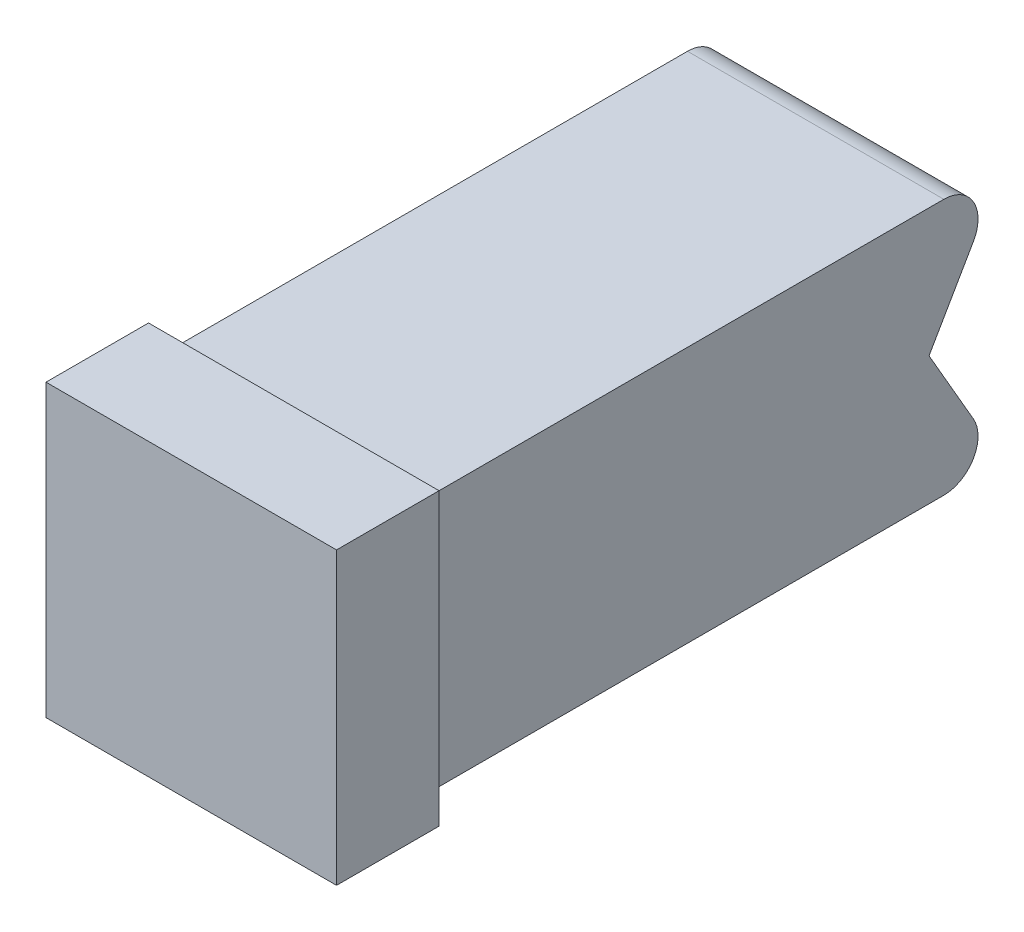
ISO-10303-21;
HEADER;
FILE_DESCRIPTION(('STEP AP214'),'2;1');
FILE_NAME('part.step','',(''),(''),'','','');
FILE_SCHEMA(('AUTOMOTIVE_DESIGN { 1 0 10303 214 1 1 1 1 }'));
ENDSEC;
DATA;
#1=APPLICATION_CONTEXT('core data for automotive mechanical design processes');
#2=APPLICATION_PROTOCOL_DEFINITION('international standard','automotive_design',2000,#1);
#3=PRODUCT_CONTEXT('',#1,'mechanical');
#4=PRODUCT('Part','Part','',(#3));
#5=PRODUCT_RELATED_PRODUCT_CATEGORY('part','',(#4));
#6=PRODUCT_DEFINITION_FORMATION('','',#4);
#7=PRODUCT_DEFINITION_CONTEXT('part definition',#1,'design');
#8=PRODUCT_DEFINITION('design','',#6,#7);
#9=PRODUCT_DEFINITION_SHAPE('','',#8);
#10=(LENGTH_UNIT() NAMED_UNIT(*) SI_UNIT(.MILLI.,.METRE.));
#11=(NAMED_UNIT(*) PLANE_ANGLE_UNIT() SI_UNIT($,.RADIAN.));
#12=(NAMED_UNIT(*) SI_UNIT($,.STERADIAN.) SOLID_ANGLE_UNIT());
#13=UNCERTAINTY_MEASURE_WITH_UNIT(LENGTH_MEASURE(1.E-05),#10,'distance_accuracy_value','');
#14=(GEOMETRIC_REPRESENTATION_CONTEXT(3) GLOBAL_UNCERTAINTY_ASSIGNED_CONTEXT((#13)) GLOBAL_UNIT_ASSIGNED_CONTEXT((#10,
#11,#12)) REPRESENTATION_CONTEXT('',''));
#15=CARTESIAN_POINT('',(0.,0.,0.));
#16=DIRECTION('',(0.,0.,1.));
#17=DIRECTION('',(1.,0.,0.));
#18=AXIS2_PLACEMENT_3D('',#15,#16,#17);
#19=CARTESIAN_POINT('',(0.,8.5,0.));
#20=DIRECTION('',(0.,-1.,0.));
#21=DIRECTION('',(0.,0.,-1.));
#22=AXIS2_PLACEMENT_3D('',#19,#20,#21);
#23=PLANE('',#22);
#24=DIRECTION('',(1.,0.,0.));
#25=VECTOR('',#24,1.);
#26=CARTESIAN_POINT('',(0.5,8.5,0.));
#27=LINE('',#26,#25);
#28=CARTESIAN_POINT('',(0.,8.5,0.));
#29=VERTEX_POINT('',#28);
#30=CARTESIAN_POINT('',(8.5,8.5,0.));
#31=VERTEX_POINT('',#30);
#32=EDGE_CURVE('E185',#29,#31,#27,.T.);
#33=ORIENTED_EDGE('',*,*,#32,.F.);
#34=DIRECTION('',(0.,0.,-1.));
#35=VECTOR('',#34,1.);
#36=CARTESIAN_POINT('',(0.,8.5,0.));
#37=LINE('',#36,#35);
#38=CARTESIAN_POINT('',(0.,8.5,3.));
#39=VERTEX_POINT('',#38);
#40=EDGE_CURVE('E327',#39,#29,#37,.T.);
#41=ORIENTED_EDGE('',*,*,#40,.F.);
#42=DIRECTION('',(1.,0.,0.));
#43=VECTOR('',#42,1.);
#44=CARTESIAN_POINT('',(8.,8.5,3.));
#45=LINE('',#44,#43);
#46=CARTESIAN_POINT('',(8.5,8.5,3.));
#47=VERTEX_POINT('',#46);
#48=EDGE_CURVE('E120',#39,#47,#45,.T.);
#49=ORIENTED_EDGE('',*,*,#48,.T.);
#50=DIRECTION('',(0.,0.,1.));
#51=VECTOR('',#50,1.);
#52=CARTESIAN_POINT('',(8.5,8.5,3.));
#53=LINE('',#52,#51);
#54=EDGE_CURVE('E130',#31,#47,#53,.T.);
#55=ORIENTED_EDGE('',*,*,#54,.F.);
#56=EDGE_LOOP('',(#33,#41,#49,#55));
#57=FACE_BOUND('',#56,.T.);
#58=ADVANCED_FACE('F37',(#57),#23,.F.);
#59=CARTESIAN_POINT('',(8.5,0.,0.));
#60=DIRECTION('',(-1.,0.,0.));
#61=DIRECTION('',(0.,0.,1.));
#62=AXIS2_PLACEMENT_3D('',#59,#60,#61);
#63=PLANE('',#62);
#64=DIRECTION('',(0.,-1.,0.));
#65=VECTOR('',#64,1.);
#66=CARTESIAN_POINT('',(8.5,8.5,0.));
#67=LINE('',#66,#65);
#68=CARTESIAN_POINT('',(8.5,0.,0.));
#69=VERTEX_POINT('',#68);
#70=EDGE_CURVE('E181',#31,#69,#67,.T.);
#71=ORIENTED_EDGE('',*,*,#70,.F.);
#72=ORIENTED_EDGE('',*,*,#54,.T.);
#73=DIRECTION('',(0.,-1.,0.));
#74=VECTOR('',#73,1.);
#75=CARTESIAN_POINT('',(8.5,0.5,3.));
#76=LINE('',#75,#74);
#77=CARTESIAN_POINT('',(8.5,0.,3.));
#78=VERTEX_POINT('',#77);
#79=EDGE_CURVE('E122',#47,#78,#76,.T.);
#80=ORIENTED_EDGE('',*,*,#79,.T.);
#81=DIRECTION('',(0.,0.,1.));
#82=VECTOR('',#81,1.);
#83=CARTESIAN_POINT('',(8.5,0.,3.));
#84=LINE('',#83,#82);
#85=EDGE_CURVE('E167',#69,#78,#84,.T.);
#86=ORIENTED_EDGE('',*,*,#85,.F.);
#87=EDGE_LOOP('',(#71,#72,#80,#86));
#88=FACE_BOUND('',#87,.T.);
#89=ADVANCED_FACE('F175',(#88),#63,.F.);
#90=CARTESIAN_POINT('',(0.,0.,0.));
#91=DIRECTION('',(0.,1.,0.));
#92=DIRECTION('',(0.,0.,1.));
#93=AXIS2_PLACEMENT_3D('',#90,#91,#92);
#94=PLANE('',#93);
#95=DIRECTION('',(-1.,0.,0.));
#96=VECTOR('',#95,1.);
#97=CARTESIAN_POINT('',(8.5,0.,0.));
#98=LINE('',#97,#96);
#99=CARTESIAN_POINT('',(0.,0.,0.));
#100=VERTEX_POINT('',#99);
#101=EDGE_CURVE('E208',#69,#100,#98,.T.);
#102=ORIENTED_EDGE('',*,*,#101,.F.);
#103=ORIENTED_EDGE('',*,*,#85,.T.);
#104=DIRECTION('',(-1.,0.,0.));
#105=VECTOR('',#104,1.);
#106=CARTESIAN_POINT('',(0.5,0.,3.));
#107=LINE('',#106,#105);
#108=CARTESIAN_POINT('',(0.,0.,3.));
#109=VERTEX_POINT('',#108);
#110=EDGE_CURVE('E170',#78,#109,#107,.T.);
#111=ORIENTED_EDGE('',*,*,#110,.T.);
#112=DIRECTION('',(0.,0.,1.));
#113=VECTOR('',#112,1.);
#114=CARTESIAN_POINT('',(0.,0.,3.));
#115=LINE('',#114,#113);
#116=EDGE_CURVE('E210',#100,#109,#115,.T.);
#117=ORIENTED_EDGE('',*,*,#116,.F.);
#118=EDGE_LOOP('',(#102,#103,#111,#117));
#119=FACE_BOUND('',#118,.T.);
#120=ADVANCED_FACE('F203',(#119),#94,.F.);
#121=CARTESIAN_POINT('',(8.,7.,-15.2679491924311));
#122=DIRECTION('',(-1.,0.,0.));
#123=DIRECTION('',(0.,0.,1.));
#124=AXIS2_PLACEMENT_3D('',#121,#122,#123);
#125=PLANE('',#124);
#126=CARTESIAN_POINT('',(8.,7.,-15.2679491924311));
#127=DIRECTION('',(-1.,0.,0.));
#128=DIRECTION('',(0.,0.,1.));
#129=AXIS2_PLACEMENT_3D('',#126,#127,#128);
#130=CIRCLE('',#129,1.00000000000001);
#131=CARTESIAN_POINT('',(8.,8.,-15.2679491924311));
#132=VERTEX_POINT('',#131);
#133=CARTESIAN_POINT('',(8.,6.50000000000001,-16.1339745962156));
#134=VERTEX_POINT('',#133);
#135=EDGE_CURVE('E95',#132,#134,#130,.T.);
#136=ORIENTED_EDGE('',*,*,#135,.F.);
#137=DIRECTION('',(0.,0.,-1.));
#138=VECTOR('',#137,1.);
#139=CARTESIAN_POINT('',(8.,8.,-14.8349364905389));
#140=LINE('',#139,#138);
#141=CARTESIAN_POINT('',(8.,8.,0.));
#142=VERTEX_POINT('',#141);
#143=EDGE_CURVE('E154',#142,#132,#140,.T.);
#144=ORIENTED_EDGE('',*,*,#143,.F.);
#145=DIRECTION('',(0.,1.,0.));
#146=VECTOR('',#145,1.);
#147=CARTESIAN_POINT('',(8.,0.5,0.));
#148=LINE('',#147,#146);
#149=CARTESIAN_POINT('',(8.,0.5,0.));
#150=VERTEX_POINT('',#149);
#151=EDGE_CURVE('E148',#150,#142,#148,.T.);
#152=ORIENTED_EDGE('',*,*,#151,.F.);
#153=DIRECTION('',(0.,0.,-1.));
#154=VECTOR('',#153,1.);
#155=CARTESIAN_POINT('',(8.,0.5,-14.8349364905389));
#156=LINE('',#155,#154);
#157=CARTESIAN_POINT('',(8.,0.5,-15.2679491924311));
#158=VERTEX_POINT('',#157);
#159=EDGE_CURVE('E144',#150,#158,#156,.T.);
#160=ORIENTED_EDGE('',*,*,#159,.T.);
#161=CARTESIAN_POINT('',(8.,1.5,-15.2679491924311));
#162=DIRECTION('',(-1.,0.,0.));
#163=DIRECTION('',(0.,0.,1.));
#164=AXIS2_PLACEMENT_3D('',#161,#162,#163);
#165=CIRCLE('',#164,1.00000000000001);
#166=CARTESIAN_POINT('',(8.,1.99999999999999,-16.1339745962156));
#167=VERTEX_POINT('',#166);
#168=EDGE_CURVE('E107',#167,#158,#165,.T.);
#169=ORIENTED_EDGE('',*,*,#168,.F.);
#170=DIRECTION('',(0.,-0.866025403784438,-0.500000000000001));
#171=VECTOR('',#170,1.);
#172=CARTESIAN_POINT('',(8.,4.25,-14.8349364905389));
#173=LINE('',#172,#171);
#174=CARTESIAN_POINT('',(8.,4.25000000000001,-14.8349364905389));
#175=VERTEX_POINT('',#174);
#176=EDGE_CURVE('E56',#175,#167,#173,.T.);
#177=ORIENTED_EDGE('',*,*,#176,.F.);
#178=DIRECTION('',(0.,-0.866025403784437,0.500000000000003));
#179=VECTOR('',#178,1.);
#180=CARTESIAN_POINT('',(8.,6.5,-16.1339745962156));
#181=LINE('',#180,#179);
#182=EDGE_CURVE('E98',#134,#175,#181,.T.);
#183=ORIENTED_EDGE('',*,*,#182,.F.);
#184=EDGE_LOOP('',(#136,#144,#152,#160,#169,#177,#183));
#185=FACE_BOUND('',#184,.T.);
#186=ADVANCED_FACE('F140',(#185),#125,.F.);
#187=CARTESIAN_POINT('',(8.,1.5,-15.2679491924311));
#188=DIRECTION('',(-1.,0.,0.));
#189=DIRECTION('',(0.,0.,1.));
#190=AXIS2_PLACEMENT_3D('',#187,#188,#189);
#191=CYLINDRICAL_SURFACE('',#190,1.00000000000001);
#192=CARTESIAN_POINT('',(0.5,1.5,-15.2679491924311));
#193=DIRECTION('',(-1.,0.,0.));
#194=DIRECTION('',(0.,0.,1.));
#195=AXIS2_PLACEMENT_3D('',#192,#193,#194);
#196=CIRCLE('',#195,1.00000000000001);
#197=CARTESIAN_POINT('',(0.5,1.99999999999999,-16.1339745962156));
#198=VERTEX_POINT('',#197);
#199=CARTESIAN_POINT('',(0.5,0.5,-15.2679491924311));
#200=VERTEX_POINT('',#199);
#201=EDGE_CURVE('E88',#198,#200,#196,.T.);
#202=ORIENTED_EDGE('',*,*,#201,.F.);
#203=DIRECTION('',(-1.,0.,0.));
#204=VECTOR('',#203,1.);
#205=CARTESIAN_POINT('',(8.,1.99999999999999,-16.1339745962156));
#206=LINE('',#205,#204);
#207=EDGE_CURVE('E72',#167,#198,#206,.T.);
#208=ORIENTED_EDGE('',*,*,#207,.F.);
#209=ORIENTED_EDGE('',*,*,#168,.T.);
#210=DIRECTION('',(-1.,0.,0.));
#211=VECTOR('',#210,1.);
#212=CARTESIAN_POINT('',(8.,0.499999999999993,-15.2679491924311));
#213=LINE('',#212,#211);
#214=EDGE_CURVE('E47',#158,#200,#213,.T.);
#215=ORIENTED_EDGE('',*,*,#214,.T.);
#216=EDGE_LOOP('',(#202,#208,#209,#215));
#217=FACE_BOUND('',#216,.T.);
#218=ADVANCED_FACE('F93',(#217),#191,.T.);
#219=CARTESIAN_POINT('',(8.,4.25,-14.8349364905389));
#220=DIRECTION('',(0.,0.500000000000001,-0.866025403784438));
#221=DIRECTION('',(0.,0.866025403784438,0.500000000000001));
#222=AXIS2_PLACEMENT_3D('',#219,#220,#221);
#223=PLANE('',#222);
#224=DIRECTION('',(0.,-0.866025403784438,-0.500000000000001));
#225=VECTOR('',#224,1.);
#226=CARTESIAN_POINT('',(0.5,4.25,-14.8349364905389));
#227=LINE('',#226,#225);
#228=CARTESIAN_POINT('',(0.5,4.25,-14.8349364905389));
#229=VERTEX_POINT('',#228);
#230=EDGE_CURVE('E75',#229,#198,#227,.T.);
#231=ORIENTED_EDGE('',*,*,#230,.F.);
#232=DIRECTION('',(-1.,0.,0.));
#233=VECTOR('',#232,1.);
#234=CARTESIAN_POINT('',(8.,4.25,-14.8349364905389));
#235=LINE('',#234,#233);
#236=EDGE_CURVE('E70',#175,#229,#235,.T.);
#237=ORIENTED_EDGE('',*,*,#236,.F.);
#238=ORIENTED_EDGE('',*,*,#176,.T.);
#239=ORIENTED_EDGE('',*,*,#207,.T.);
#240=EDGE_LOOP('',(#231,#237,#238,#239));
#241=FACE_BOUND('',#240,.T.);
#242=ADVANCED_FACE('F74',(#241),#223,.T.);
#243=CARTESIAN_POINT('',(8.,6.5,-16.1339745962156));
#244=DIRECTION('',(0.,-0.500000000000003,-0.866025403784437));
#245=DIRECTION('',(0.,0.866025403784437,-0.500000000000003));
#246=AXIS2_PLACEMENT_3D('',#243,#244,#245);
#247=PLANE('',#246);
#248=DIRECTION('',(0.,-0.866025403784437,0.500000000000003));
#249=VECTOR('',#248,1.);
#250=CARTESIAN_POINT('',(0.5,6.5,-16.1339745962156));
#251=LINE('',#250,#249);
#252=CARTESIAN_POINT('',(0.5,6.50000000000001,-16.1339745962156));
#253=VERTEX_POINT('',#252);
#254=EDGE_CURVE('E90',#253,#229,#251,.T.);
#255=ORIENTED_EDGE('',*,*,#254,.F.);
#256=DIRECTION('',(-1.,0.,0.));
#257=VECTOR('',#256,1.);
#258=CARTESIAN_POINT('',(8.,6.50000000000001,-16.1339745962156));
#259=LINE('',#258,#257);
#260=EDGE_CURVE('E103',#134,#253,#259,.T.);
#261=ORIENTED_EDGE('',*,*,#260,.F.);
#262=ORIENTED_EDGE('',*,*,#182,.T.);
#263=ORIENTED_EDGE('',*,*,#236,.T.);
#264=EDGE_LOOP('',(#255,#261,#262,#263));
#265=FACE_BOUND('',#264,.T.);
#266=ADVANCED_FACE('F135',(#265),#247,.T.);
#267=CARTESIAN_POINT('',(8.,7.,-15.2679491924311));
#268=DIRECTION('',(-1.,0.,0.));
#269=DIRECTION('',(0.,0.,1.));
#270=AXIS2_PLACEMENT_3D('',#267,#268,#269);
#271=CYLINDRICAL_SURFACE('',#270,1.00000000000001);
#272=CARTESIAN_POINT('',(0.5,7.,-15.2679491924311));
#273=DIRECTION('',(-1.,0.,0.));
#274=DIRECTION('',(0.,0.,1.));
#275=AXIS2_PLACEMENT_3D('',#272,#273,#274);
#276=CIRCLE('',#275,1.00000000000001);
#277=CARTESIAN_POINT('',(0.5,8.,-15.2679491924311));
#278=VERTEX_POINT('',#277);
#279=EDGE_CURVE('E119',#278,#253,#276,.T.);
#280=ORIENTED_EDGE('',*,*,#279,.F.);
#281=DIRECTION('',(-1.,0.,0.));
#282=VECTOR('',#281,1.);
#283=CARTESIAN_POINT('',(8.,8.,-15.2679491924311));
#284=LINE('',#283,#282);
#285=EDGE_CURVE('E41',#132,#278,#284,.T.);
#286=ORIENTED_EDGE('',*,*,#285,.F.);
#287=ORIENTED_EDGE('',*,*,#135,.T.);
#288=ORIENTED_EDGE('',*,*,#260,.T.);
#289=EDGE_LOOP('',(#280,#286,#287,#288));
#290=FACE_BOUND('',#289,.T.);
#291=ADVANCED_FACE('F221',(#290),#271,.T.);
#292=CARTESIAN_POINT('',(8.,0.5,3.));
#293=DIRECTION('',(0.,0.,1.));
#294=DIRECTION('',(1.,0.,0.));
#295=AXIS2_PLACEMENT_3D('',#292,#293,#294);
#296=PLANE('',#295);
#297=ORIENTED_EDGE('',*,*,#48,.F.);
#298=DIRECTION('',(0.,1.,0.));
#299=VECTOR('',#298,1.);
#300=CARTESIAN_POINT('',(0.,8.5,3.));
#301=LINE('',#300,#299);
#302=EDGE_CURVE('E330',#109,#39,#301,.T.);
#303=ORIENTED_EDGE('',*,*,#302,.F.);
#304=ORIENTED_EDGE('',*,*,#110,.F.);
#305=ORIENTED_EDGE('',*,*,#79,.F.);
#306=EDGE_LOOP('',(#297,#303,#304,#305));
#307=FACE_BOUND('',#306,.T.);
#308=ADVANCED_FACE('F39',(#307),#296,.T.);
#309=CARTESIAN_POINT('',(0.5,7.,-15.2679491924311));
#310=DIRECTION('',(-1.,0.,0.));
#311=DIRECTION('',(0.,0.,1.));
#312=AXIS2_PLACEMENT_3D('',#309,#310,#311);
#313=PLANE('',#312);
#314=DIRECTION('',(0.,-1.,0.));
#315=VECTOR('',#314,1.);
#316=CARTESIAN_POINT('',(0.5,0.,0.));
#317=LINE('',#316,#315);
#318=CARTESIAN_POINT('',(0.5,8.,0.));
#319=VERTEX_POINT('',#318);
#320=CARTESIAN_POINT('',(0.5,0.5,0.));
#321=VERTEX_POINT('',#320);
#322=EDGE_CURVE('E11',#319,#321,#317,.T.);
#323=ORIENTED_EDGE('',*,*,#322,.F.);
#324=DIRECTION('',(0.,0.,-1.));
#325=VECTOR('',#324,1.);
#326=CARTESIAN_POINT('',(0.5,8.,-14.8349364905389));
#327=LINE('',#326,#325);
#328=EDGE_CURVE('E162',#319,#278,#327,.T.);
#329=ORIENTED_EDGE('',*,*,#328,.T.);
#330=ORIENTED_EDGE('',*,*,#279,.T.);
#331=ORIENTED_EDGE('',*,*,#254,.T.);
#332=ORIENTED_EDGE('',*,*,#230,.T.);
#333=ORIENTED_EDGE('',*,*,#201,.T.);
#334=DIRECTION('',(0.,0.,-1.));
#335=VECTOR('',#334,1.);
#336=CARTESIAN_POINT('',(0.5,0.5,-14.8349364905389));
#337=LINE('',#336,#335);
#338=EDGE_CURVE('E155',#321,#200,#337,.T.);
#339=ORIENTED_EDGE('',*,*,#338,.F.);
#340=EDGE_LOOP('',(#323,#329,#330,#331,#332,#333,#339));
#341=FACE_BOUND('',#340,.T.);
#342=ADVANCED_FACE('F85',(#341),#313,.T.);
#343=CARTESIAN_POINT('',(8.,8.,-14.8349364905389));
#344=DIRECTION('',(0.,-1.,0.));
#345=DIRECTION('',(0.,0.,-1.));
#346=AXIS2_PLACEMENT_3D('',#343,#344,#345);
#347=PLANE('',#346);
#348=ORIENTED_EDGE('',*,*,#285,.T.);
#349=ORIENTED_EDGE('',*,*,#328,.F.);
#350=DIRECTION('',(-1.,0.,0.));
#351=VECTOR('',#350,1.);
#352=CARTESIAN_POINT('',(8.,8.,0.));
#353=LINE('',#352,#351);
#354=EDGE_CURVE('E220',#142,#319,#353,.T.);
#355=ORIENTED_EDGE('',*,*,#354,.F.);
#356=ORIENTED_EDGE('',*,*,#143,.T.);
#357=EDGE_LOOP('',(#348,#349,#355,#356));
#358=FACE_BOUND('',#357,.T.);
#359=ADVANCED_FACE('F218',(#358),#347,.F.);
#360=CARTESIAN_POINT('',(0.5,0.5,-14.8349364905389));
#361=DIRECTION('',(0.,1.,0.));
#362=DIRECTION('',(-1.,0.,0.));
#363=AXIS2_PLACEMENT_3D('',#360,#361,#362);
#364=PLANE('',#363);
#365=ORIENTED_EDGE('',*,*,#214,.F.);
#366=ORIENTED_EDGE('',*,*,#159,.F.);
#367=DIRECTION('',(1.,0.,0.));
#368=VECTOR('',#367,1.);
#369=CARTESIAN_POINT('',(0.5,0.5,0.));
#370=LINE('',#369,#368);
#371=EDGE_CURVE('E160',#321,#150,#370,.T.);
#372=ORIENTED_EDGE('',*,*,#371,.F.);
#373=ORIENTED_EDGE('',*,*,#338,.T.);
#374=EDGE_LOOP('',(#365,#366,#372,#373));
#375=FACE_BOUND('',#374,.T.);
#376=ADVANCED_FACE('F158',(#375),#364,.F.);
#377=CARTESIAN_POINT('',(0.,0.,0.));
#378=DIRECTION('',(0.,0.,-1.));
#379=DIRECTION('',(-1.,0.,0.));
#380=AXIS2_PLACEMENT_3D('',#377,#378,#379);
#381=PLANE('',#380);
#382=DIRECTION('',(0.,-1.,0.));
#383=VECTOR('',#382,1.);
#384=CARTESIAN_POINT('',(0.,0.,0.));
#385=LINE('',#384,#383);
#386=EDGE_CURVE('E328',#29,#100,#385,.T.);
#387=ORIENTED_EDGE('',*,*,#386,.F.);
#388=ORIENTED_EDGE('',*,*,#32,.T.);
#389=ORIENTED_EDGE('',*,*,#70,.T.);
#390=ORIENTED_EDGE('',*,*,#101,.T.);
#391=EDGE_LOOP('',(#387,#388,#389,#390));
#392=FACE_BOUND('',#391,.T.);
#393=ORIENTED_EDGE('',*,*,#354,.T.);
#394=ORIENTED_EDGE('',*,*,#322,.T.);
#395=ORIENTED_EDGE('',*,*,#371,.T.);
#396=ORIENTED_EDGE('',*,*,#151,.T.);
#397=EDGE_LOOP('',(#393,#394,#395,#396));
#398=FACE_BOUND('',#397,.T.);
#399=ADVANCED_FACE('F303',(#392,#398),#381,.T.);
#400=CARTESIAN_POINT('',(0.,0.,0.));
#401=DIRECTION('',(1.,0.,0.));
#402=DIRECTION('',(0.,0.,-1.));
#403=AXIS2_PLACEMENT_3D('',#400,#401,#402);
#404=PLANE('',#403);
#405=ORIENTED_EDGE('',*,*,#40,.T.);
#406=ORIENTED_EDGE('',*,*,#386,.T.);
#407=ORIENTED_EDGE('',*,*,#116,.T.);
#408=ORIENTED_EDGE('',*,*,#302,.T.);
#409=EDGE_LOOP('',(#405,#406,#407,#408));
#410=FACE_BOUND('',#409,.T.);
#411=ADVANCED_FACE('F312',(#410),#404,.F.);
#412=CLOSED_SHELL('',(#58,#89,#120,#186,#218,#242,#266,#291,#308,#342,#359,#376,#399,#411));
#413=MANIFOLD_SOLID_BREP('B2',#412);
#414=ADVANCED_BREP_SHAPE_REPRESENTATION('',(#18,#413),#14);
#415=SHAPE_DEFINITION_REPRESENTATION(#9,#414);
ENDSEC;
END-ISO-10303-21;
